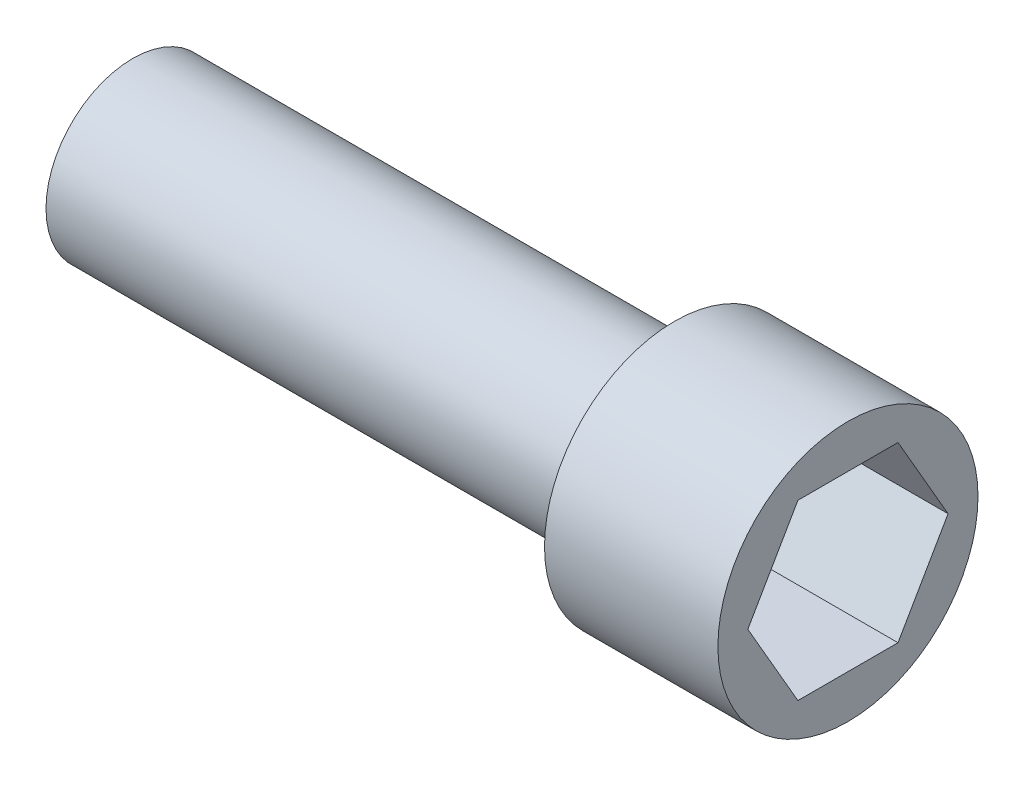
ISO-10303-21;
HEADER;
FILE_DESCRIPTION(('STEP AP214'),'2;1');
FILE_NAME('part.step','',(''),(''),'','','');
FILE_SCHEMA(('AUTOMOTIVE_DESIGN { 1 0 10303 214 1 1 1 1 }'));
ENDSEC;
DATA;
#1=APPLICATION_CONTEXT('core data for automotive mechanical design processes');
#2=APPLICATION_PROTOCOL_DEFINITION('international standard','automotive_design',2000,#1);
#3=PRODUCT_CONTEXT('',#1,'mechanical');
#4=PRODUCT('Part','Part','',(#3));
#5=PRODUCT_RELATED_PRODUCT_CATEGORY('part','',(#4));
#6=PRODUCT_DEFINITION_FORMATION('','',#4);
#7=PRODUCT_DEFINITION_CONTEXT('part definition',#1,'design');
#8=PRODUCT_DEFINITION('design','',#6,#7);
#9=PRODUCT_DEFINITION_SHAPE('','',#8);
#10=(LENGTH_UNIT() NAMED_UNIT(*) SI_UNIT(.MILLI.,.METRE.));
#11=(NAMED_UNIT(*) PLANE_ANGLE_UNIT() SI_UNIT($,.RADIAN.));
#12=(NAMED_UNIT(*) SI_UNIT($,.STERADIAN.) SOLID_ANGLE_UNIT());
#13=UNCERTAINTY_MEASURE_WITH_UNIT(LENGTH_MEASURE(1.E-05),#10,'distance_accuracy_value','');
#14=(GEOMETRIC_REPRESENTATION_CONTEXT(3) GLOBAL_UNCERTAINTY_ASSIGNED_CONTEXT((#13)) GLOBAL_UNIT_ASSIGNED_CONTEXT((#10,
#11,#12)) REPRESENTATION_CONTEXT('',''));
#15=CARTESIAN_POINT('',(0.,0.,0.));
#16=DIRECTION('',(0.,0.,1.));
#17=DIRECTION('',(1.,0.,0.));
#18=AXIS2_PLACEMENT_3D('',#15,#16,#17);
#19=CARTESIAN_POINT('',(16.5,5.99999999999999,0.));
#20=DIRECTION('',(1.,0.,0.));
#21=DIRECTION('',(0.,1.,0.));
#22=AXIS2_PLACEMENT_3D('',#19,#20,#21);
#23=PLANE('',#22);
#24=DIRECTION('',(0.,0.866025403784439,-0.5));
#25=VECTOR('',#24,1.);
#26=CARTESIAN_POINT('',(16.5,-4.,-2.3094010767585));
#27=LINE('',#26,#25);
#28=CARTESIAN_POINT('',(16.5,-4.,-2.3094010767585));
#29=VERTEX_POINT('',#28);
#30=CARTESIAN_POINT('',(16.5,0.,-4.61880215351701));
#31=VERTEX_POINT('',#30);
#32=EDGE_CURVE('E58',#29,#31,#27,.T.);
#33=ORIENTED_EDGE('',*,*,#32,.F.);
#34=DIRECTION('',(0.,0.,-1.));
#35=VECTOR('',#34,1.);
#36=CARTESIAN_POINT('',(16.5,-4.,2.3094010767585));
#37=LINE('',#36,#35);
#38=CARTESIAN_POINT('',(16.5,-4.,2.3094010767585));
#39=VERTEX_POINT('',#38);
#40=EDGE_CURVE('E151',#39,#29,#37,.T.);
#41=ORIENTED_EDGE('',*,*,#40,.F.);
#42=DIRECTION('',(0.,-0.866025403784438,-0.5));
#43=VECTOR('',#42,1.);
#44=CARTESIAN_POINT('',(16.5,0.,4.61880215351701));
#45=LINE('',#44,#43);
#46=CARTESIAN_POINT('',(16.5,0.,4.61880215351701));
#47=VERTEX_POINT('',#46);
#48=EDGE_CURVE('E148',#47,#39,#45,.T.);
#49=ORIENTED_EDGE('',*,*,#48,.F.);
#50=DIRECTION('',(0.,-0.866025403784439,0.5));
#51=VECTOR('',#50,1.);
#52=CARTESIAN_POINT('',(16.5,4.,2.3094010767585));
#53=LINE('',#52,#51);
#54=CARTESIAN_POINT('',(16.5,4.,2.3094010767585));
#55=VERTEX_POINT('',#54);
#56=EDGE_CURVE('E106',#55,#47,#53,.T.);
#57=ORIENTED_EDGE('',*,*,#56,.F.);
#58=DIRECTION('',(0.,0.,1.));
#59=VECTOR('',#58,1.);
#60=CARTESIAN_POINT('',(16.5,4.,-2.3094010767585));
#61=LINE('',#60,#59);
#62=CARTESIAN_POINT('',(16.5,4.,-2.3094010767585));
#63=VERTEX_POINT('',#62);
#64=EDGE_CURVE('E142',#63,#55,#61,.T.);
#65=ORIENTED_EDGE('',*,*,#64,.F.);
#66=DIRECTION('',(0.,0.866025403784438,0.5));
#67=VECTOR('',#66,1.);
#68=CARTESIAN_POINT('',(16.5,0.,-4.61880215351701));
#69=LINE('',#68,#67);
#70=EDGE_CURVE('E138',#31,#63,#69,.T.);
#71=ORIENTED_EDGE('',*,*,#70,.F.);
#72=EDGE_LOOP('',(#33,#41,#49,#57,#65,#71));
#73=FACE_BOUND('',#72,.T.);
#74=CARTESIAN_POINT('',(16.5,0.,0.));
#75=DIRECTION('',(1.,0.,0.));
#76=DIRECTION('',(0.,1.,0.));
#77=AXIS2_PLACEMENT_3D('',#74,#75,#76);
#78=CIRCLE('',#77,5.99999999999999);
#79=CARTESIAN_POINT('',(16.5,5.99999999999999,0.));
#80=VERTEX_POINT('',#79);
#81=EDGE_CURVE('E157',#80,#80,#78,.T.);
#82=ORIENTED_EDGE('',*,*,#81,.T.);
#83=EDGE_LOOP('',(#82));
#84=FACE_BOUND('',#83,.T.);
#85=ADVANCED_FACE('F43',(#73,#84),#23,.T.);
#86=CARTESIAN_POINT('',(-16.5,0.,0.));
#87=DIRECTION('',(-1.,0.,0.));
#88=DIRECTION('',(0.,-1.,0.));
#89=AXIS2_PLACEMENT_3D('',#86,#87,#88);
#90=PLANE('',#89);
#91=CARTESIAN_POINT('',(-16.5,0.,0.));
#92=DIRECTION('',(1.,0.,0.));
#93=DIRECTION('',(0.,1.,0.));
#94=AXIS2_PLACEMENT_3D('',#91,#92,#93);
#95=CIRCLE('',#94,4.);
#96=CARTESIAN_POINT('',(-16.5,4.,0.));
#97=VERTEX_POINT('',#96);
#98=EDGE_CURVE('E11',#97,#97,#95,.T.);
#99=ORIENTED_EDGE('',*,*,#98,.F.);
#100=EDGE_LOOP('',(#99));
#101=FACE_BOUND('',#100,.T.);
#102=ADVANCED_FACE('F182',(#101),#90,.T.);
#103=CARTESIAN_POINT('',(16.5,0.,0.));
#104=DIRECTION('',(1.,0.,0.));
#105=DIRECTION('',(0.,1.,0.));
#106=AXIS2_PLACEMENT_3D('',#103,#104,#105);
#107=CYLINDRICAL_SURFACE('',#106,4.);
#108=ORIENTED_EDGE('',*,*,#98,.T.);
#109=EDGE_LOOP('',(#108));
#110=FACE_BOUND('',#109,.T.);
#111=CARTESIAN_POINT('',(8.5,0.,0.));
#112=DIRECTION('',(1.,0.,0.));
#113=DIRECTION('',(0.,1.,0.));
#114=AXIS2_PLACEMENT_3D('',#111,#112,#113);
#115=CIRCLE('',#114,4.);
#116=CARTESIAN_POINT('',(8.5,3.99999999999999,0.));
#117=VERTEX_POINT('',#116);
#118=EDGE_CURVE('E51',#117,#117,#115,.T.);
#119=ORIENTED_EDGE('',*,*,#118,.F.);
#120=EDGE_LOOP('',(#119));
#121=FACE_BOUND('',#120,.T.);
#122=ADVANCED_FACE('F180',(#110,#121),#107,.T.);
#123=CARTESIAN_POINT('',(8.5,3.99999999999999,0.));
#124=DIRECTION('',(-1.,0.,0.));
#125=DIRECTION('',(0.,-1.,0.));
#126=AXIS2_PLACEMENT_3D('',#123,#124,#125);
#127=PLANE('',#126);
#128=ORIENTED_EDGE('',*,*,#118,.T.);
#129=EDGE_LOOP('',(#128));
#130=FACE_BOUND('',#129,.T.);
#131=CARTESIAN_POINT('',(8.5,0.,0.));
#132=DIRECTION('',(1.,0.,0.));
#133=DIRECTION('',(0.,1.,0.));
#134=AXIS2_PLACEMENT_3D('',#131,#132,#133);
#135=CIRCLE('',#134,6.);
#136=CARTESIAN_POINT('',(8.5,5.99999999999999,0.));
#137=VERTEX_POINT('',#136);
#138=EDGE_CURVE('E170',#137,#137,#135,.T.);
#139=ORIENTED_EDGE('',*,*,#138,.F.);
#140=EDGE_LOOP('',(#139));
#141=FACE_BOUND('',#140,.T.);
#142=ADVANCED_FACE('F177',(#130,#141),#127,.T.);
#143=CARTESIAN_POINT('',(16.5,0.,0.));
#144=DIRECTION('',(1.,0.,0.));
#145=DIRECTION('',(0.,1.,0.));
#146=AXIS2_PLACEMENT_3D('',#143,#144,#145);
#147=CYLINDRICAL_SURFACE('',#146,5.99999999999999);
#148=ORIENTED_EDGE('',*,*,#138,.T.);
#149=EDGE_LOOP('',(#148));
#150=FACE_BOUND('',#149,.T.);
#151=ORIENTED_EDGE('',*,*,#81,.F.);
#152=EDGE_LOOP('',(#151));
#153=FACE_BOUND('',#152,.T.);
#154=ADVANCED_FACE('F189',(#150,#153),#147,.T.);
#155=CARTESIAN_POINT('',(10.5,-4.,-2.3094010767585));
#156=DIRECTION('',(0.,-0.5,-0.866025403784439));
#157=DIRECTION('',(0.,0.866025403784439,-0.5));
#158=AXIS2_PLACEMENT_3D('',#155,#156,#157);
#159=PLANE('',#158);
#160=ORIENTED_EDGE('',*,*,#32,.T.);
#161=DIRECTION('',(1.,0.,0.));
#162=VECTOR('',#161,1.);
#163=CARTESIAN_POINT('',(10.5,0.,-4.61880215351701));
#164=LINE('',#163,#162);
#165=CARTESIAN_POINT('',(10.5,0.,-4.61880215351701));
#166=VERTEX_POINT('',#165);
#167=EDGE_CURVE('E88',#166,#31,#164,.T.);
#168=ORIENTED_EDGE('',*,*,#167,.F.);
#169=DIRECTION('',(0.,0.866025403784439,-0.5));
#170=VECTOR('',#169,1.);
#171=CARTESIAN_POINT('',(10.5,-4.,-2.3094010767585));
#172=LINE('',#171,#170);
#173=CARTESIAN_POINT('',(10.5,-4.,-2.3094010767585));
#174=VERTEX_POINT('',#173);
#175=EDGE_CURVE('E154',#174,#166,#172,.T.);
#176=ORIENTED_EDGE('',*,*,#175,.F.);
#177=DIRECTION('',(1.,0.,0.));
#178=VECTOR('',#177,1.);
#179=CARTESIAN_POINT('',(10.5,-4.,-2.3094010767585));
#180=LINE('',#179,#178);
#181=EDGE_CURVE('E66',#174,#29,#180,.T.);
#182=ORIENTED_EDGE('',*,*,#181,.T.);
#183=EDGE_LOOP('',(#160,#168,#176,#182));
#184=FACE_BOUND('',#183,.T.);
#185=ADVANCED_FACE('F202',(#184),#159,.F.);
#186=CARTESIAN_POINT('',(10.5,-4.,2.3094010767585));
#187=DIRECTION('',(0.,-1.,0.));
#188=DIRECTION('',(0.,0.,-1.));
#189=AXIS2_PLACEMENT_3D('',#186,#187,#188);
#190=PLANE('',#189);
#191=ORIENTED_EDGE('',*,*,#40,.T.);
#192=ORIENTED_EDGE('',*,*,#181,.F.);
#193=DIRECTION('',(0.,0.,-1.));
#194=VECTOR('',#193,1.);
#195=CARTESIAN_POINT('',(10.5,-4.,2.3094010767585));
#196=LINE('',#195,#194);
#197=CARTESIAN_POINT('',(10.5,-4.,2.3094010767585));
#198=VERTEX_POINT('',#197);
#199=EDGE_CURVE('E120',#198,#174,#196,.T.);
#200=ORIENTED_EDGE('',*,*,#199,.F.);
#201=DIRECTION('',(1.,0.,0.));
#202=VECTOR('',#201,1.);
#203=CARTESIAN_POINT('',(10.5,-4.,2.3094010767585));
#204=LINE('',#203,#202);
#205=EDGE_CURVE('E111',#198,#39,#204,.T.);
#206=ORIENTED_EDGE('',*,*,#205,.T.);
#207=EDGE_LOOP('',(#191,#192,#200,#206));
#208=FACE_BOUND('',#207,.T.);
#209=ADVANCED_FACE('F208',(#208),#190,.F.);
#210=CARTESIAN_POINT('',(10.5,0.,4.61880215351701));
#211=DIRECTION('',(0.,-0.5,0.866025403784438));
#212=DIRECTION('',(0.,-0.866025403784439,-0.5));
#213=AXIS2_PLACEMENT_3D('',#210,#211,#212);
#214=PLANE('',#213);
#215=ORIENTED_EDGE('',*,*,#48,.T.);
#216=ORIENTED_EDGE('',*,*,#205,.F.);
#217=DIRECTION('',(0.,-0.866025403784438,-0.5));
#218=VECTOR('',#217,1.);
#219=CARTESIAN_POINT('',(10.5,0.,4.61880215351701));
#220=LINE('',#219,#218);
#221=CARTESIAN_POINT('',(10.5,0.,4.61880215351701));
#222=VERTEX_POINT('',#221);
#223=EDGE_CURVE('E115',#222,#198,#220,.T.);
#224=ORIENTED_EDGE('',*,*,#223,.F.);
#225=DIRECTION('',(1.,0.,0.));
#226=VECTOR('',#225,1.);
#227=CARTESIAN_POINT('',(10.5,0.,4.61880215351701));
#228=LINE('',#227,#226);
#229=EDGE_CURVE('E99',#222,#47,#228,.T.);
#230=ORIENTED_EDGE('',*,*,#229,.T.);
#231=EDGE_LOOP('',(#215,#216,#224,#230));
#232=FACE_BOUND('',#231,.T.);
#233=ADVANCED_FACE('F116',(#232),#214,.F.);
#234=CARTESIAN_POINT('',(10.5,4.,2.3094010767585));
#235=DIRECTION('',(0.,0.5,0.866025403784439));
#236=DIRECTION('',(0.,-0.866025403784439,0.5));
#237=AXIS2_PLACEMENT_3D('',#234,#235,#236);
#238=PLANE('',#237);
#239=ORIENTED_EDGE('',*,*,#56,.T.);
#240=ORIENTED_EDGE('',*,*,#229,.F.);
#241=DIRECTION('',(0.,-0.866025403784439,0.5));
#242=VECTOR('',#241,1.);
#243=CARTESIAN_POINT('',(10.5,4.,2.3094010767585));
#244=LINE('',#243,#242);
#245=CARTESIAN_POINT('',(10.5,4.,2.3094010767585));
#246=VERTEX_POINT('',#245);
#247=EDGE_CURVE('E103',#246,#222,#244,.T.);
#248=ORIENTED_EDGE('',*,*,#247,.F.);
#249=DIRECTION('',(1.,0.,0.));
#250=VECTOR('',#249,1.);
#251=CARTESIAN_POINT('',(10.5,4.,2.3094010767585));
#252=LINE('',#251,#250);
#253=EDGE_CURVE('E112',#246,#55,#252,.T.);
#254=ORIENTED_EDGE('',*,*,#253,.T.);
#255=EDGE_LOOP('',(#239,#240,#248,#254));
#256=FACE_BOUND('',#255,.T.);
#257=ADVANCED_FACE('F101',(#256),#238,.F.);
#258=CARTESIAN_POINT('',(10.5,4.,-2.3094010767585));
#259=DIRECTION('',(0.,1.,0.));
#260=DIRECTION('',(-1.,0.,0.));
#261=AXIS2_PLACEMENT_3D('',#258,#259,#260);
#262=PLANE('',#261);
#263=ORIENTED_EDGE('',*,*,#64,.T.);
#264=ORIENTED_EDGE('',*,*,#253,.F.);
#265=DIRECTION('',(0.,0.,1.));
#266=VECTOR('',#265,1.);
#267=CARTESIAN_POINT('',(10.5,4.,-2.3094010767585));
#268=LINE('',#267,#266);
#269=CARTESIAN_POINT('',(10.5,4.,-2.3094010767585));
#270=VERTEX_POINT('',#269);
#271=EDGE_CURVE('E126',#270,#246,#268,.T.);
#272=ORIENTED_EDGE('',*,*,#271,.F.);
#273=DIRECTION('',(1.,0.,0.));
#274=VECTOR('',#273,1.);
#275=CARTESIAN_POINT('',(10.5,4.,-2.3094010767585));
#276=LINE('',#275,#274);
#277=EDGE_CURVE('E162',#270,#63,#276,.T.);
#278=ORIENTED_EDGE('',*,*,#277,.T.);
#279=EDGE_LOOP('',(#263,#264,#272,#278));
#280=FACE_BOUND('',#279,.T.);
#281=ADVANCED_FACE('F214',(#280),#262,.F.);
#282=CARTESIAN_POINT('',(10.5,0.,-4.61880215351701));
#283=DIRECTION('',(0.,0.5,-0.866025403784439));
#284=DIRECTION('',(0.,0.866025403784439,0.5));
#285=AXIS2_PLACEMENT_3D('',#282,#283,#284);
#286=PLANE('',#285);
#287=ORIENTED_EDGE('',*,*,#70,.T.);
#288=ORIENTED_EDGE('',*,*,#277,.F.);
#289=DIRECTION('',(0.,0.866025403784438,0.5));
#290=VECTOR('',#289,1.);
#291=CARTESIAN_POINT('',(10.5,0.,-4.61880215351701));
#292=LINE('',#291,#290);
#293=EDGE_CURVE('E130',#166,#270,#292,.T.);
#294=ORIENTED_EDGE('',*,*,#293,.F.);
#295=ORIENTED_EDGE('',*,*,#167,.T.);
#296=EDGE_LOOP('',(#287,#288,#294,#295));
#297=FACE_BOUND('',#296,.T.);
#298=ADVANCED_FACE('F211',(#297),#286,.F.);
#299=CARTESIAN_POINT('',(10.5,0.,0.));
#300=DIRECTION('',(1.,0.,0.));
#301=DIRECTION('',(0.,0.,-1.));
#302=AXIS2_PLACEMENT_3D('',#299,#300,#301);
#303=PLANE('',#302);
#304=ORIENTED_EDGE('',*,*,#175,.T.);
#305=ORIENTED_EDGE('',*,*,#293,.T.);
#306=ORIENTED_EDGE('',*,*,#271,.T.);
#307=ORIENTED_EDGE('',*,*,#247,.T.);
#308=ORIENTED_EDGE('',*,*,#223,.T.);
#309=ORIENTED_EDGE('',*,*,#199,.T.);
#310=EDGE_LOOP('',(#304,#305,#306,#307,#308,#309));
#311=FACE_BOUND('',#310,.T.);
#312=ADVANCED_FACE('F123',(#311),#303,.T.);
#313=CLOSED_SHELL('',(#85,#102,#122,#142,#154,#185,#209,#233,#257,#281,#298,#312));
#314=MANIFOLD_SOLID_BREP('B2',#313);
#315=ADVANCED_BREP_SHAPE_REPRESENTATION('',(#18,#314),#14);
#316=SHAPE_DEFINITION_REPRESENTATION(#9,#315);
ENDSEC;
END-ISO-10303-21;
